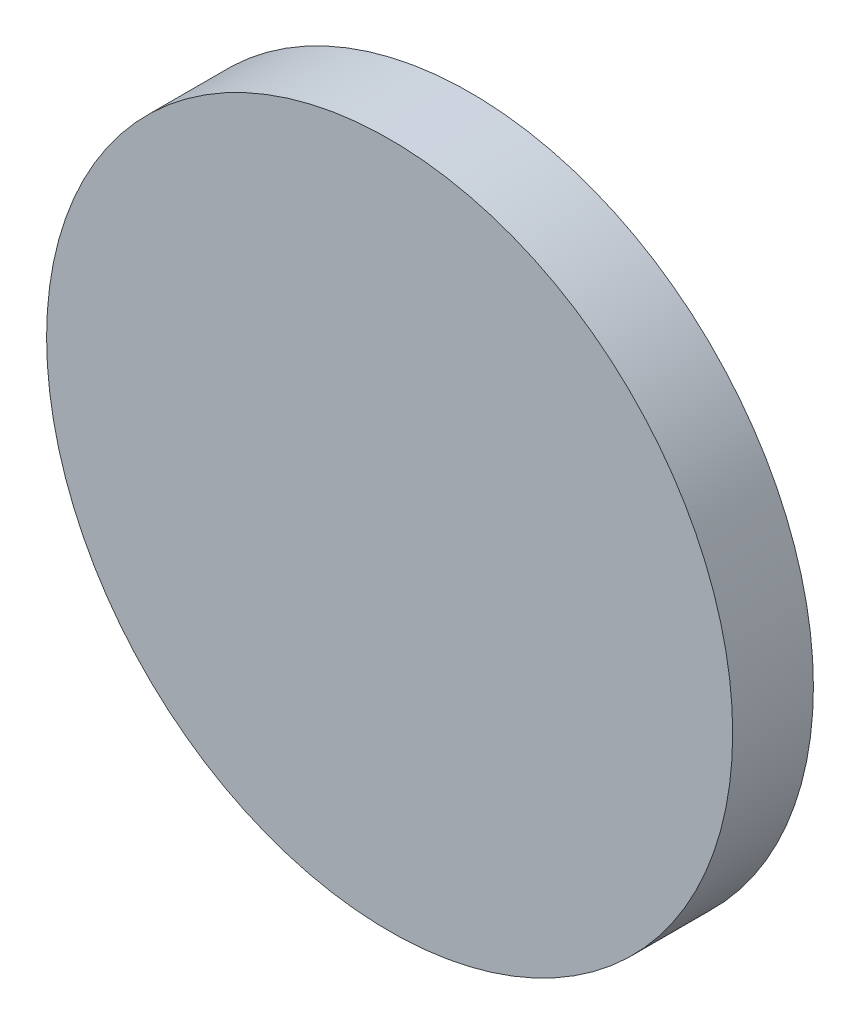
ISO-10303-21;
HEADER;
FILE_DESCRIPTION(('STEP AP214'),'2;1');
FILE_NAME('part.step','',(''),(''),'','','');
FILE_SCHEMA(('AUTOMOTIVE_DESIGN { 1 0 10303 214 1 1 1 1 }'));
ENDSEC;
DATA;
#1=APPLICATION_CONTEXT('core data for automotive mechanical design processes');
#2=APPLICATION_PROTOCOL_DEFINITION('international standard','automotive_design',2000,#1);
#3=PRODUCT_CONTEXT('',#1,'mechanical');
#4=PRODUCT('Part','Part','',(#3));
#5=PRODUCT_RELATED_PRODUCT_CATEGORY('part','',(#4));
#6=PRODUCT_DEFINITION_FORMATION('','',#4);
#7=PRODUCT_DEFINITION_CONTEXT('part definition',#1,'design');
#8=PRODUCT_DEFINITION('design','',#6,#7);
#9=PRODUCT_DEFINITION_SHAPE('','',#8);
#10=(LENGTH_UNIT() NAMED_UNIT(*) SI_UNIT(.MILLI.,.METRE.));
#11=(NAMED_UNIT(*) PLANE_ANGLE_UNIT() SI_UNIT($,.RADIAN.));
#12=(NAMED_UNIT(*) SI_UNIT($,.STERADIAN.) SOLID_ANGLE_UNIT());
#13=UNCERTAINTY_MEASURE_WITH_UNIT(LENGTH_MEASURE(1.E-05),#10,'distance_accuracy_value','');
#14=(GEOMETRIC_REPRESENTATION_CONTEXT(3) GLOBAL_UNCERTAINTY_ASSIGNED_CONTEXT((#13)) GLOBAL_UNIT_ASSIGNED_CONTEXT((#10,
#11,#12)) REPRESENTATION_CONTEXT('',''));
#15=CARTESIAN_POINT('',(0.,0.,0.));
#16=DIRECTION('',(0.,0.,1.));
#17=DIRECTION('',(1.,0.,0.));
#18=AXIS2_PLACEMENT_3D('',#15,#16,#17);
#19=CARTESIAN_POINT('',(0.,0.,4.));
#20=DIRECTION('',(0.,0.,-1.));
#21=DIRECTION('',(-1.,0.,0.));
#22=AXIS2_PLACEMENT_3D('',#19,#20,#21);
#23=CYLINDRICAL_SURFACE('',#22,17.);
#24=CARTESIAN_POINT('',(0.,0.,4.));
#25=DIRECTION('',(0.,0.,1.));
#26=DIRECTION('',(1.,0.,0.));
#27=AXIS2_PLACEMENT_3D('',#24,#25,#26);
#28=CIRCLE('',#27,17.);
#29=CARTESIAN_POINT('',(17.,0.,4.));
#30=VERTEX_POINT('',#29);
#31=EDGE_CURVE('E10',#30,#30,#28,.T.);
#32=ORIENTED_EDGE('',*,*,#31,.F.);
#33=EDGE_LOOP('',(#32));
#34=FACE_BOUND('',#33,.T.);
#35=CARTESIAN_POINT('',(0.,0.,0.));
#36=DIRECTION('',(0.,0.,1.));
#37=DIRECTION('',(1.,0.,0.));
#38=AXIS2_PLACEMENT_3D('',#35,#36,#37);
#39=CIRCLE('',#38,17.);
#40=CARTESIAN_POINT('',(17.,0.,0.));
#41=VERTEX_POINT('',#40);
#42=EDGE_CURVE('E35',#41,#41,#39,.T.);
#43=ORIENTED_EDGE('',*,*,#42,.T.);
#44=EDGE_LOOP('',(#43));
#45=FACE_BOUND('',#44,.T.);
#46=ADVANCED_FACE('F32',(#34,#45),#23,.T.);
#47=CARTESIAN_POINT('',(0.,0.,4.));
#48=DIRECTION('',(0.,0.,1.));
#49=DIRECTION('',(1.,0.,0.));
#50=AXIS2_PLACEMENT_3D('',#47,#48,#49);
#51=PLANE('',#50);
#52=ORIENTED_EDGE('',*,*,#31,.T.);
#53=EDGE_LOOP('',(#52));
#54=FACE_BOUND('',#53,.T.);
#55=ADVANCED_FACE('F47',(#54),#51,.T.);
#56=CARTESIAN_POINT('',(0.,0.,0.));
#57=DIRECTION('',(0.,0.,1.));
#58=DIRECTION('',(1.,0.,0.));
#59=AXIS2_PLACEMENT_3D('',#56,#57,#58);
#60=PLANE('',#59);
#61=ORIENTED_EDGE('',*,*,#42,.F.);
#62=EDGE_LOOP('',(#61));
#63=FACE_BOUND('',#62,.T.);
#64=ADVANCED_FACE('F45',(#63),#60,.F.);
#65=CLOSED_SHELL('',(#46,#55,#64));
#66=MANIFOLD_SOLID_BREP('B2',#65);
#67=ADVANCED_BREP_SHAPE_REPRESENTATION('',(#18,#66),#14);
#68=SHAPE_DEFINITION_REPRESENTATION(#9,#67);
ENDSEC;
END-ISO-10303-21;
